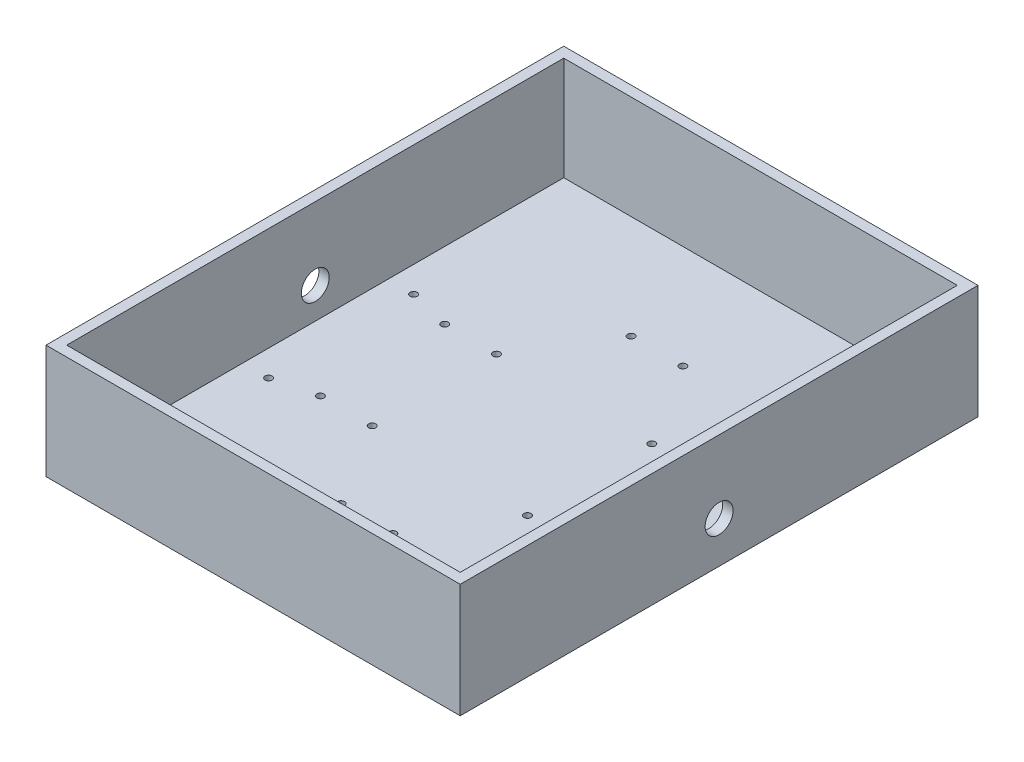
ISO-10303-21;
HEADER;
FILE_DESCRIPTION(('STEP AP214'),'2;1');
FILE_NAME('part.step','',(''),(''),'','','');
FILE_SCHEMA(('AUTOMOTIVE_DESIGN { 1 0 10303 214 1 1 1 1 }'));
ENDSEC;
DATA;
#1=APPLICATION_CONTEXT('core data for automotive mechanical design processes');
#2=APPLICATION_PROTOCOL_DEFINITION('international standard','automotive_design',2000,#1);
#3=PRODUCT_CONTEXT('',#1,'mechanical');
#4=PRODUCT('Part','Part','',(#3));
#5=PRODUCT_RELATED_PRODUCT_CATEGORY('part','',(#4));
#6=PRODUCT_DEFINITION_FORMATION('','',#4);
#7=PRODUCT_DEFINITION_CONTEXT('part definition',#1,'design');
#8=PRODUCT_DEFINITION('design','',#6,#7);
#9=PRODUCT_DEFINITION_SHAPE('','',#8);
#10=(LENGTH_UNIT() NAMED_UNIT(*) SI_UNIT(.MILLI.,.METRE.));
#11=(NAMED_UNIT(*) PLANE_ANGLE_UNIT() SI_UNIT($,.RADIAN.));
#12=(NAMED_UNIT(*) SI_UNIT($,.STERADIAN.) SOLID_ANGLE_UNIT());
#13=UNCERTAINTY_MEASURE_WITH_UNIT(LENGTH_MEASURE(1.E-05),#10,'distance_accuracy_value','');
#14=(GEOMETRIC_REPRESENTATION_CONTEXT(3) GLOBAL_UNCERTAINTY_ASSIGNED_CONTEXT((#13)) GLOBAL_UNIT_ASSIGNED_CONTEXT((#10,
#11,#12)) REPRESENTATION_CONTEXT('',''));
#15=CARTESIAN_POINT('',(0.,0.,0.));
#16=DIRECTION('',(0.,0.,1.));
#17=DIRECTION('',(1.,0.,0.));
#18=AXIS2_PLACEMENT_3D('',#15,#16,#17);
#19=CARTESIAN_POINT('',(-95.,50.,120.));
#20=DIRECTION('',(0.,-1.,0.));
#21=DIRECTION('',(1.,0.,0.));
#22=AXIS2_PLACEMENT_3D('',#19,#20,#21);
#23=PLANE('',#22);
#24=DIRECTION('',(-1.,0.,0.));
#25=VECTOR('',#24,1.);
#26=CARTESIAN_POINT('',(0.,50.,-125.));
#27=LINE('',#26,#25);
#28=CARTESIAN_POINT('',(100.,50.,-125.));
#29=VERTEX_POINT('',#28);
#30=CARTESIAN_POINT('',(-100.,50.,-125.));
#31=VERTEX_POINT('',#30);
#32=EDGE_CURVE('E88',#29,#31,#27,.T.);
#33=ORIENTED_EDGE('',*,*,#32,.T.);
#34=DIRECTION('',(0.,0.,-1.));
#35=VECTOR('',#34,1.);
#36=CARTESIAN_POINT('',(-100.,50.,120.));
#37=LINE('',#36,#35);
#38=CARTESIAN_POINT('',(-100.,50.,125.));
#39=VERTEX_POINT('',#38);
#40=EDGE_CURVE('E175',#39,#31,#37,.T.);
#41=ORIENTED_EDGE('',*,*,#40,.F.);
#42=DIRECTION('',(-1.,0.,0.));
#43=VECTOR('',#42,1.);
#44=CARTESIAN_POINT('',(0.,50.,125.));
#45=LINE('',#44,#43);
#46=CARTESIAN_POINT('',(100.,50.,125.));
#47=VERTEX_POINT('',#46);
#48=EDGE_CURVE('E72',#47,#39,#45,.T.);
#49=ORIENTED_EDGE('',*,*,#48,.F.);
#50=DIRECTION('',(0.,0.,-1.));
#51=VECTOR('',#50,1.);
#52=CARTESIAN_POINT('',(100.,50.,120.));
#53=LINE('',#52,#51);
#54=EDGE_CURVE('E167',#47,#29,#53,.T.);
#55=ORIENTED_EDGE('',*,*,#54,.T.);
#56=EDGE_LOOP('',(#33,#41,#49,#55));
#57=FACE_BOUND('',#56,.T.);
#58=DIRECTION('',(-1.,0.,0.));
#59=VECTOR('',#58,1.);
#60=CARTESIAN_POINT('',(-95.,50.,-120.));
#61=LINE('',#60,#59);
#62=CARTESIAN_POINT('',(95.,50.,-120.));
#63=VERTEX_POINT('',#62);
#64=CARTESIAN_POINT('',(-95.,50.,-120.));
#65=VERTEX_POINT('',#64);
#66=EDGE_CURVE('E141',#63,#65,#61,.T.);
#67=ORIENTED_EDGE('',*,*,#66,.F.);
#68=DIRECTION('',(0.,0.,-1.));
#69=VECTOR('',#68,1.);
#70=CARTESIAN_POINT('',(95.,50.,120.));
#71=LINE('',#70,#69);
#72=CARTESIAN_POINT('',(95.,50.,120.));
#73=VERTEX_POINT('',#72);
#74=EDGE_CURVE('E154',#73,#63,#71,.T.);
#75=ORIENTED_EDGE('',*,*,#74,.F.);
#76=DIRECTION('',(-1.,0.,0.));
#77=VECTOR('',#76,1.);
#78=CARTESIAN_POINT('',(-95.,50.,120.));
#79=LINE('',#78,#77);
#80=CARTESIAN_POINT('',(-95.,50.,120.));
#81=VERTEX_POINT('',#80);
#82=EDGE_CURVE('E63',#73,#81,#79,.T.);
#83=ORIENTED_EDGE('',*,*,#82,.T.);
#84=DIRECTION('',(0.,0.,-1.));
#85=VECTOR('',#84,1.);
#86=CARTESIAN_POINT('',(-95.,50.,120.));
#87=LINE('',#86,#85);
#88=EDGE_CURVE('E139',#81,#65,#87,.T.);
#89=ORIENTED_EDGE('',*,*,#88,.T.);
#90=EDGE_LOOP('',(#67,#75,#83,#89));
#91=FACE_BOUND('',#90,.T.);
#92=ADVANCED_FACE('F45',(#57,#91),#23,.F.);
#93=CARTESIAN_POINT('',(-100.,0.,120.));
#94=DIRECTION('',(1.,0.,0.));
#95=DIRECTION('',(0.,0.,-1.));
#96=AXIS2_PLACEMENT_3D('',#93,#94,#95);
#97=PLANE('',#96);
#98=CARTESIAN_POINT('',(-100.,15.,0.));
#99=DIRECTION('',(1.,0.,0.));
#100=DIRECTION('',(0.,0.,-1.));
#101=AXIS2_PLACEMENT_3D('',#98,#99,#100);
#102=CIRCLE('',#101,6.75);
#103=CARTESIAN_POINT('',(-100.,15.,-6.75));
#104=VERTEX_POINT('',#103);
#105=EDGE_CURVE('E339',#104,#104,#102,.T.);
#106=ORIENTED_EDGE('',*,*,#105,.T.);
#107=EDGE_LOOP('',(#106));
#108=FACE_BOUND('',#107,.T.);
#109=DIRECTION('',(0.,-1.,0.));
#110=VECTOR('',#109,1.);
#111=CARTESIAN_POINT('',(-100.,0.,-125.));
#112=LINE('',#111,#110);
#113=CARTESIAN_POINT('',(-100.,-5.,-125.));
#114=VERTEX_POINT('',#113);
#115=EDGE_CURVE('E146',#31,#114,#112,.T.);
#116=ORIENTED_EDGE('',*,*,#115,.T.);
#117=DIRECTION('',(0.,0.,-1.));
#118=VECTOR('',#117,1.);
#119=CARTESIAN_POINT('',(-100.,-5.,120.));
#120=LINE('',#119,#118);
#121=CARTESIAN_POINT('',(-100.,-5.,125.));
#122=VERTEX_POINT('',#121);
#123=EDGE_CURVE('E11',#122,#114,#120,.T.);
#124=ORIENTED_EDGE('',*,*,#123,.F.);
#125=DIRECTION('',(0.,-1.,0.));
#126=VECTOR('',#125,1.);
#127=CARTESIAN_POINT('',(-100.,0.,125.));
#128=LINE('',#127,#126);
#129=EDGE_CURVE('E158',#39,#122,#128,.T.);
#130=ORIENTED_EDGE('',*,*,#129,.F.);
#131=ORIENTED_EDGE('',*,*,#40,.T.);
#132=EDGE_LOOP('',(#116,#124,#130,#131));
#133=FACE_BOUND('',#132,.T.);
#134=ADVANCED_FACE('F287',(#108,#133),#97,.F.);
#135=CARTESIAN_POINT('',(-95.,-5.,120.));
#136=DIRECTION('',(0.,1.,0.));
#137=DIRECTION('',(-1.,0.,0.));
#138=AXIS2_PLACEMENT_3D('',#135,#136,#137);
#139=PLANE('',#138);
#140=CARTESIAN_POINT('',(-82.5000000000123,-5.00000000000002,35.));
#141=DIRECTION('',(0.,1.,0.));
#142=DIRECTION('',(1.,0.,0.));
#143=AXIS2_PLACEMENT_3D('',#140,#141,#142);
#144=CIRCLE('',#143,1.69999999999998);
#145=CARTESIAN_POINT('',(-80.8000000000124,-5.00000000000002,35.));
#146=VERTEX_POINT('',#145);
#147=EDGE_CURVE('E347',#146,#146,#144,.T.);
#148=ORIENTED_EDGE('',*,*,#147,.T.);
#149=EDGE_LOOP('',(#148));
#150=FACE_BOUND('',#149,.T.);
#151=CARTESIAN_POINT('',(82.5000000000123,-5.,35.));
#152=DIRECTION('',(0.,1.,0.));
#153=DIRECTION('',(-1.,0.,0.));
#154=AXIS2_PLACEMENT_3D('',#151,#152,#153);
#155=CIRCLE('',#154,1.69999999999998);
#156=CARTESIAN_POINT('',(80.8000000000123,-5.,35.));
#157=VERTEX_POINT('',#156);
#158=EDGE_CURVE('E376',#157,#157,#155,.T.);
#159=ORIENTED_EDGE('',*,*,#158,.T.);
#160=EDGE_LOOP('',(#159));
#161=FACE_BOUND('',#160,.T.);
#162=CARTESIAN_POINT('',(62.4999999999998,-5.00000000000001,30.));
#163=DIRECTION('',(0.,1.,0.));
#164=DIRECTION('',(-1.,0.,0.));
#165=AXIS2_PLACEMENT_3D('',#162,#163,#164);
#166=CIRCLE('',#165,1.70000000000001);
#167=CARTESIAN_POINT('',(60.7999999999998,-5.00000000000001,30.));
#168=VERTEX_POINT('',#167);
#169=EDGE_CURVE('E372',#168,#168,#166,.T.);
#170=ORIENTED_EDGE('',*,*,#169,.T.);
#171=EDGE_LOOP('',(#170));
#172=FACE_BOUND('',#171,.T.);
#173=CARTESIAN_POINT('',(37.4999999999998,-5.00000000000001,30.));
#174=DIRECTION('',(0.,1.,0.));
#175=DIRECTION('',(-1.,0.,0.));
#176=AXIS2_PLACEMENT_3D('',#173,#174,#175);
#177=CIRCLE('',#176,1.70000000000001);
#178=CARTESIAN_POINT('',(35.7999999999998,-5.00000000000001,30.));
#179=VERTEX_POINT('',#178);
#180=EDGE_CURVE('E367',#179,#179,#177,.T.);
#181=ORIENTED_EDGE('',*,*,#180,.T.);
#182=EDGE_LOOP('',(#181));
#183=FACE_BOUND('',#182,.T.);
#184=CARTESIAN_POINT('',(12.5,-5.00000000000001,69.99999999998));
#185=DIRECTION('',(0.,1.,0.));
#186=DIRECTION('',(-1.,0.,0.));
#187=AXIS2_PLACEMENT_3D('',#184,#185,#186);
#188=CIRCLE('',#187,1.70000000000001);
#189=CARTESIAN_POINT('',(10.8,-5.00000000000001,69.99999999998));
#190=VERTEX_POINT('',#189);
#191=EDGE_CURVE('E371',#190,#190,#188,.T.);
#192=ORIENTED_EDGE('',*,*,#191,.T.);
#193=EDGE_LOOP('',(#192));
#194=FACE_BOUND('',#193,.T.);
#195=CARTESIAN_POINT('',(12.5,-5.00000000000001,-69.99999999998));
#196=DIRECTION('',(0.,1.,0.));
#197=DIRECTION('',(1.,0.,0.));
#198=AXIS2_PLACEMENT_3D('',#195,#196,#197);
#199=CIRCLE('',#198,1.70000000000001);
#200=CARTESIAN_POINT('',(14.2,-5.00000000000001,-69.99999999998));
#201=VERTEX_POINT('',#200);
#202=EDGE_CURVE('E391',#201,#201,#199,.T.);
#203=ORIENTED_EDGE('',*,*,#202,.T.);
#204=EDGE_LOOP('',(#203));
#205=FACE_BOUND('',#204,.T.);
#206=CARTESIAN_POINT('',(37.4999999999998,-5.00000000000001,-30.));
#207=DIRECTION('',(0.,1.,0.));
#208=DIRECTION('',(1.,0.,0.));
#209=AXIS2_PLACEMENT_3D('',#206,#207,#208);
#210=CIRCLE('',#209,1.70000000000001);
#211=CARTESIAN_POINT('',(39.1999999999999,-5.00000000000001,-30.));
#212=VERTEX_POINT('',#211);
#213=EDGE_CURVE('E387',#212,#212,#210,.T.);
#214=ORIENTED_EDGE('',*,*,#213,.T.);
#215=EDGE_LOOP('',(#214));
#216=FACE_BOUND('',#215,.T.);
#217=CARTESIAN_POINT('',(62.4999999999999,-5.00000000000001,-30.));
#218=DIRECTION('',(0.,1.,0.));
#219=DIRECTION('',(1.,0.,0.));
#220=AXIS2_PLACEMENT_3D('',#217,#218,#219);
#221=CIRCLE('',#220,1.70000000000001);
#222=CARTESIAN_POINT('',(64.1999999999999,-5.00000000000001,-30.));
#223=VERTEX_POINT('',#222);
#224=EDGE_CURVE('E383',#223,#223,#221,.T.);
#225=ORIENTED_EDGE('',*,*,#224,.T.);
#226=EDGE_LOOP('',(#225));
#227=FACE_BOUND('',#226,.T.);
#228=CARTESIAN_POINT('',(-12.5,-5.00000000000002,-69.99999999998));
#229=DIRECTION('',(0.,1.,0.));
#230=DIRECTION('',(-1.,0.,0.));
#231=AXIS2_PLACEMENT_3D('',#228,#229,#230);
#232=CIRCLE('',#231,1.70000000000001);
#233=CARTESIAN_POINT('',(-14.2,-5.00000000000002,-69.99999999998));
#234=VERTEX_POINT('',#233);
#235=EDGE_CURVE('E343',#234,#234,#232,.T.);
#236=ORIENTED_EDGE('',*,*,#235,.T.);
#237=EDGE_LOOP('',(#236));
#238=FACE_BOUND('',#237,.T.);
#239=CARTESIAN_POINT('',(-37.4999999999998,-5.00000000000002,-30.));
#240=DIRECTION('',(0.,1.,0.));
#241=DIRECTION('',(-1.,0.,0.));
#242=AXIS2_PLACEMENT_3D('',#239,#240,#241);
#243=CIRCLE('',#242,1.70000000000001);
#244=CARTESIAN_POINT('',(-39.1999999999999,-5.00000000000002,-30.));
#245=VERTEX_POINT('',#244);
#246=EDGE_CURVE('E348',#245,#245,#243,.T.);
#247=ORIENTED_EDGE('',*,*,#246,.T.);
#248=EDGE_LOOP('',(#247));
#249=FACE_BOUND('',#248,.T.);
#250=CARTESIAN_POINT('',(-62.4999999999999,-5.00000000000002,-30.));
#251=DIRECTION('',(0.,1.,0.));
#252=DIRECTION('',(-1.,0.,0.));
#253=AXIS2_PLACEMENT_3D('',#250,#251,#252);
#254=CIRCLE('',#253,1.70000000000001);
#255=CARTESIAN_POINT('',(-64.1999999999999,-5.00000000000002,-30.));
#256=VERTEX_POINT('',#255);
#257=EDGE_CURVE('E352',#256,#256,#254,.T.);
#258=ORIENTED_EDGE('',*,*,#257,.T.);
#259=EDGE_LOOP('',(#258));
#260=FACE_BOUND('',#259,.T.);
#261=CARTESIAN_POINT('',(-82.5000000000124,-5.00000000000002,-35.));
#262=DIRECTION('',(0.,1.,0.));
#263=DIRECTION('',(-1.,0.,0.));
#264=AXIS2_PLACEMENT_3D('',#261,#262,#263);
#265=CIRCLE('',#264,1.69999999999998);
#266=CARTESIAN_POINT('',(-84.2000000000124,-5.00000000000002,-35.));
#267=VERTEX_POINT('',#266);
#268=EDGE_CURVE('E356',#267,#267,#265,.T.);
#269=ORIENTED_EDGE('',*,*,#268,.T.);
#270=EDGE_LOOP('',(#269));
#271=FACE_BOUND('',#270,.T.);
#272=CARTESIAN_POINT('',(-62.4999999999999,-5.00000000000002,30.));
#273=DIRECTION('',(0.,1.,0.));
#274=DIRECTION('',(1.,0.,0.));
#275=AXIS2_PLACEMENT_3D('',#272,#273,#274);
#276=CIRCLE('',#275,1.70000000000001);
#277=CARTESIAN_POINT('',(-60.7999999999998,-5.00000000000002,30.));
#278=VERTEX_POINT('',#277);
#279=EDGE_CURVE('E360',#278,#278,#276,.T.);
#280=ORIENTED_EDGE('',*,*,#279,.T.);
#281=EDGE_LOOP('',(#280));
#282=FACE_BOUND('',#281,.T.);
#283=CARTESIAN_POINT('',(-37.4999999999998,-5.00000000000002,30.));
#284=DIRECTION('',(0.,1.,0.));
#285=DIRECTION('',(1.,0.,0.));
#286=AXIS2_PLACEMENT_3D('',#283,#284,#285);
#287=CIRCLE('',#286,1.70000000000001);
#288=CARTESIAN_POINT('',(-35.7999999999998,-5.00000000000002,30.));
#289=VERTEX_POINT('',#288);
#290=EDGE_CURVE('E336',#289,#289,#287,.T.);
#291=ORIENTED_EDGE('',*,*,#290,.T.);
#292=EDGE_LOOP('',(#291));
#293=FACE_BOUND('',#292,.T.);
#294=CARTESIAN_POINT('',(-12.5,-5.00000000000002,69.99999999998));
#295=DIRECTION('',(0.,1.,0.));
#296=DIRECTION('',(1.,0.,0.));
#297=AXIS2_PLACEMENT_3D('',#294,#295,#296);
#298=CIRCLE('',#297,1.70000000000001);
#299=CARTESIAN_POINT('',(-10.8,-5.00000000000002,69.99999999998));
#300=VERTEX_POINT('',#299);
#301=EDGE_CURVE('E331',#300,#300,#298,.T.);
#302=ORIENTED_EDGE('',*,*,#301,.T.);
#303=EDGE_LOOP('',(#302));
#304=FACE_BOUND('',#303,.T.);
#305=CARTESIAN_POINT('',(82.5000000000124,-5.,-35.));
#306=DIRECTION('',(0.,1.,0.));
#307=DIRECTION('',(1.,0.,0.));
#308=AXIS2_PLACEMENT_3D('',#305,#306,#307);
#309=CIRCLE('',#308,1.69999999999998);
#310=CARTESIAN_POINT('',(84.2000000000124,-5.,-35.));
#311=VERTEX_POINT('',#310);
#312=EDGE_CURVE('E189',#311,#311,#309,.T.);
#313=ORIENTED_EDGE('',*,*,#312,.T.);
#314=EDGE_LOOP('',(#313));
#315=FACE_BOUND('',#314,.T.);
#316=DIRECTION('',(1.,0.,0.));
#317=VECTOR('',#316,1.);
#318=CARTESIAN_POINT('',(0.,-4.99999999999999,-125.));
#319=LINE('',#318,#317);
#320=CARTESIAN_POINT('',(100.,-4.99999999999998,-125.));
#321=VERTEX_POINT('',#320);
#322=EDGE_CURVE('E152',#114,#321,#319,.T.);
#323=ORIENTED_EDGE('',*,*,#322,.T.);
#324=DIRECTION('',(0.,0.,-1.));
#325=VECTOR('',#324,1.);
#326=CARTESIAN_POINT('',(100.,-4.99999999999998,120.));
#327=LINE('',#326,#325);
#328=CARTESIAN_POINT('',(100.,-4.99999999999998,125.));
#329=VERTEX_POINT('',#328);
#330=EDGE_CURVE('E55',#329,#321,#327,.T.);
#331=ORIENTED_EDGE('',*,*,#330,.F.);
#332=DIRECTION('',(1.,0.,0.));
#333=VECTOR('',#332,1.);
#334=CARTESIAN_POINT('',(0.,-4.99999999999999,125.));
#335=LINE('',#334,#333);
#336=EDGE_CURVE('E94',#122,#329,#335,.T.);
#337=ORIENTED_EDGE('',*,*,#336,.F.);
#338=ORIENTED_EDGE('',*,*,#123,.T.);
#339=EDGE_LOOP('',(#323,#331,#337,#338));
#340=FACE_BOUND('',#339,.T.);
#341=ADVANCED_FACE('F293',(#150,#161,#172,#183,#194,#205,#216,#227,#238,#249,#260,#271,#282,
#293,#304,#315,#340),#139,.F.);
#342=CARTESIAN_POINT('',(100.,0.,120.));
#343=DIRECTION('',(-1.,0.,0.));
#344=DIRECTION('',(0.,-1.,0.));
#345=AXIS2_PLACEMENT_3D('',#342,#343,#344);
#346=PLANE('',#345);
#347=CARTESIAN_POINT('',(100.,15.,0.));
#348=DIRECTION('',(1.,0.,0.));
#349=DIRECTION('',(0.,0.,-1.));
#350=AXIS2_PLACEMENT_3D('',#347,#348,#349);
#351=CIRCLE('',#350,6.75);
#352=CARTESIAN_POINT('',(100.,15.,-6.75));
#353=VERTEX_POINT('',#352);
#354=EDGE_CURVE('E481',#353,#353,#351,.T.);
#355=ORIENTED_EDGE('',*,*,#354,.F.);
#356=EDGE_LOOP('',(#355));
#357=FACE_BOUND('',#356,.T.);
#358=DIRECTION('',(0.,1.,0.));
#359=VECTOR('',#358,1.);
#360=CARTESIAN_POINT('',(100.,0.,-125.));
#361=LINE('',#360,#359);
#362=EDGE_CURVE('E163',#321,#29,#361,.T.);
#363=ORIENTED_EDGE('',*,*,#362,.T.);
#364=ORIENTED_EDGE('',*,*,#54,.F.);
#365=DIRECTION('',(0.,1.,0.));
#366=VECTOR('',#365,1.);
#367=CARTESIAN_POINT('',(100.,0.,125.));
#368=LINE('',#367,#366);
#369=EDGE_CURVE('E170',#329,#47,#368,.T.);
#370=ORIENTED_EDGE('',*,*,#369,.F.);
#371=ORIENTED_EDGE('',*,*,#330,.T.);
#372=EDGE_LOOP('',(#363,#364,#370,#371));
#373=FACE_BOUND('',#372,.T.);
#374=ADVANCED_FACE('F300',(#357,#373),#346,.F.);
#375=CARTESIAN_POINT('',(0.,0.,125.));
#376=DIRECTION('',(0.,0.,-1.));
#377=DIRECTION('',(-1.,0.,0.));
#378=AXIS2_PLACEMENT_3D('',#375,#376,#377);
#379=PLANE('',#378);
#380=ORIENTED_EDGE('',*,*,#129,.T.);
#381=ORIENTED_EDGE('',*,*,#336,.T.);
#382=ORIENTED_EDGE('',*,*,#369,.T.);
#383=ORIENTED_EDGE('',*,*,#48,.T.);
#384=EDGE_LOOP('',(#380,#381,#382,#383));
#385=FACE_BOUND('',#384,.T.);
#386=ADVANCED_FACE('F303',(#385),#379,.F.);
#387=CARTESIAN_POINT('',(0.,0.,-125.));
#388=DIRECTION('',(0.,0.,-1.));
#389=DIRECTION('',(-1.,0.,0.));
#390=AXIS2_PLACEMENT_3D('',#387,#388,#389);
#391=PLANE('',#390);
#392=ORIENTED_EDGE('',*,*,#115,.F.);
#393=ORIENTED_EDGE('',*,*,#32,.F.);
#394=ORIENTED_EDGE('',*,*,#362,.F.);
#395=ORIENTED_EDGE('',*,*,#322,.F.);
#396=EDGE_LOOP('',(#392,#393,#394,#395));
#397=FACE_BOUND('',#396,.T.);
#398=ADVANCED_FACE('F47',(#397),#391,.T.);
#399=CARTESIAN_POINT('',(-95.,0.,120.));
#400=DIRECTION('',(1.,0.,0.));
#401=DIRECTION('',(0.,0.,-1.));
#402=AXIS2_PLACEMENT_3D('',#399,#400,#401);
#403=PLANE('',#402);
#404=CARTESIAN_POINT('',(-95.,15.,0.));
#405=DIRECTION('',(1.,0.,0.));
#406=DIRECTION('',(0.,0.,-1.));
#407=AXIS2_PLACEMENT_3D('',#404,#405,#406);
#408=CIRCLE('',#407,6.75);
#409=CARTESIAN_POINT('',(-95.,15.,-6.75));
#410=VERTEX_POINT('',#409);
#411=EDGE_CURVE('E328',#410,#410,#408,.T.);
#412=ORIENTED_EDGE('',*,*,#411,.F.);
#413=EDGE_LOOP('',(#412));
#414=FACE_BOUND('',#413,.T.);
#415=DIRECTION('',(0.,-1.,0.));
#416=VECTOR('',#415,1.);
#417=CARTESIAN_POINT('',(-95.,0.,-120.));
#418=LINE('',#417,#416);
#419=CARTESIAN_POINT('',(-95.,0.,-120.));
#420=VERTEX_POINT('',#419);
#421=EDGE_CURVE('E247',#65,#420,#418,.T.);
#422=ORIENTED_EDGE('',*,*,#421,.F.);
#423=ORIENTED_EDGE('',*,*,#88,.F.);
#424=DIRECTION('',(0.,-1.,0.));
#425=VECTOR('',#424,1.);
#426=CARTESIAN_POINT('',(-95.,0.,120.));
#427=LINE('',#426,#425);
#428=CARTESIAN_POINT('',(-95.,0.,120.));
#429=VERTEX_POINT('',#428);
#430=EDGE_CURVE('E124',#81,#429,#427,.T.);
#431=ORIENTED_EDGE('',*,*,#430,.T.);
#432=DIRECTION('',(0.,0.,-1.));
#433=VECTOR('',#432,1.);
#434=CARTESIAN_POINT('',(-95.,0.,120.));
#435=LINE('',#434,#433);
#436=EDGE_CURVE('E136',#429,#420,#435,.T.);
#437=ORIENTED_EDGE('',*,*,#436,.T.);
#438=EDGE_LOOP('',(#422,#423,#431,#437));
#439=FACE_BOUND('',#438,.T.);
#440=ADVANCED_FACE('F135',(#414,#439),#403,.T.);
#441=CARTESIAN_POINT('',(-95.,0.,120.));
#442=DIRECTION('',(0.,1.,0.));
#443=DIRECTION('',(-1.,0.,0.));
#444=AXIS2_PLACEMENT_3D('',#441,#442,#443);
#445=PLANE('',#444);
#446=CARTESIAN_POINT('',(-82.5000000000123,0.,35.));
#447=DIRECTION('',(0.,1.,0.));
#448=DIRECTION('',(-1.,0.,0.));
#449=AXIS2_PLACEMENT_3D('',#446,#447,#448);
#450=CIRCLE('',#449,1.69999999999998);
#451=CARTESIAN_POINT('',(-84.2000000000123,0.,35.));
#452=VERTEX_POINT('',#451);
#453=EDGE_CURVE('E244',#452,#452,#450,.T.);
#454=ORIENTED_EDGE('',*,*,#453,.F.);
#455=EDGE_LOOP('',(#454));
#456=FACE_BOUND('',#455,.T.);
#457=CARTESIAN_POINT('',(82.5000000000123,0.,35.));
#458=DIRECTION('',(0.,1.,0.));
#459=DIRECTION('',(-1.,0.,0.));
#460=AXIS2_PLACEMENT_3D('',#457,#458,#459);
#461=CIRCLE('',#460,1.69999999999998);
#462=CARTESIAN_POINT('',(80.8000000000123,0.,35.));
#463=VERTEX_POINT('',#462);
#464=EDGE_CURVE('E241',#463,#463,#461,.T.);
#465=ORIENTED_EDGE('',*,*,#464,.F.);
#466=EDGE_LOOP('',(#465));
#467=FACE_BOUND('',#466,.T.);
#468=CARTESIAN_POINT('',(62.4999999999998,0.,30.));
#469=DIRECTION('',(0.,1.,0.));
#470=DIRECTION('',(-1.,0.,0.));
#471=AXIS2_PLACEMENT_3D('',#468,#469,#470);
#472=CIRCLE('',#471,1.70000000000001);
#473=CARTESIAN_POINT('',(60.7999999999998,0.,30.));
#474=VERTEX_POINT('',#473);
#475=EDGE_CURVE('E237',#474,#474,#472,.T.);
#476=ORIENTED_EDGE('',*,*,#475,.F.);
#477=EDGE_LOOP('',(#476));
#478=FACE_BOUND('',#477,.T.);
#479=CARTESIAN_POINT('',(37.4999999999998,0.,30.));
#480=DIRECTION('',(0.,1.,0.));
#481=DIRECTION('',(-1.,0.,0.));
#482=AXIS2_PLACEMENT_3D('',#479,#480,#481);
#483=CIRCLE('',#482,1.70000000000001);
#484=CARTESIAN_POINT('',(35.7999999999998,0.,30.));
#485=VERTEX_POINT('',#484);
#486=EDGE_CURVE('E233',#485,#485,#483,.T.);
#487=ORIENTED_EDGE('',*,*,#486,.F.);
#488=EDGE_LOOP('',(#487));
#489=FACE_BOUND('',#488,.T.);
#490=CARTESIAN_POINT('',(12.5,0.,69.99999999998));
#491=DIRECTION('',(0.,1.,0.));
#492=DIRECTION('',(-1.,0.,0.));
#493=AXIS2_PLACEMENT_3D('',#490,#491,#492);
#494=CIRCLE('',#493,1.70000000000001);
#495=CARTESIAN_POINT('',(10.8,0.,69.99999999998));
#496=VERTEX_POINT('',#495);
#497=EDGE_CURVE('E229',#496,#496,#494,.T.);
#498=ORIENTED_EDGE('',*,*,#497,.F.);
#499=EDGE_LOOP('',(#498));
#500=FACE_BOUND('',#499,.T.);
#501=CARTESIAN_POINT('',(12.5,0.,-69.99999999998));
#502=DIRECTION('',(0.,1.,0.));
#503=DIRECTION('',(-1.,0.,0.));
#504=AXIS2_PLACEMENT_3D('',#501,#502,#503);
#505=CIRCLE('',#504,1.70000000000001);
#506=CARTESIAN_POINT('',(10.8,0.,-69.99999999998));
#507=VERTEX_POINT('',#506);
#508=EDGE_CURVE('E225',#507,#507,#505,.T.);
#509=ORIENTED_EDGE('',*,*,#508,.F.);
#510=EDGE_LOOP('',(#509));
#511=FACE_BOUND('',#510,.T.);
#512=CARTESIAN_POINT('',(37.4999999999998,0.,-30.));
#513=DIRECTION('',(0.,1.,0.));
#514=DIRECTION('',(-1.,0.,0.));
#515=AXIS2_PLACEMENT_3D('',#512,#513,#514);
#516=CIRCLE('',#515,1.70000000000001);
#517=CARTESIAN_POINT('',(35.7999999999998,0.,-30.));
#518=VERTEX_POINT('',#517);
#519=EDGE_CURVE('E221',#518,#518,#516,.T.);
#520=ORIENTED_EDGE('',*,*,#519,.F.);
#521=EDGE_LOOP('',(#520));
#522=FACE_BOUND('',#521,.T.);
#523=CARTESIAN_POINT('',(62.4999999999999,0.,-30.));
#524=DIRECTION('',(0.,1.,0.));
#525=DIRECTION('',(-1.,0.,0.));
#526=AXIS2_PLACEMENT_3D('',#523,#524,#525);
#527=CIRCLE('',#526,1.70000000000001);
#528=CARTESIAN_POINT('',(60.7999999999999,0.,-30.));
#529=VERTEX_POINT('',#528);
#530=EDGE_CURVE('E217',#529,#529,#527,.T.);
#531=ORIENTED_EDGE('',*,*,#530,.F.);
#532=EDGE_LOOP('',(#531));
#533=FACE_BOUND('',#532,.T.);
#534=CARTESIAN_POINT('',(-12.5,0.,-69.99999999998));
#535=DIRECTION('',(0.,1.,0.));
#536=DIRECTION('',(-1.,0.,0.));
#537=AXIS2_PLACEMENT_3D('',#534,#535,#536);
#538=CIRCLE('',#537,1.70000000000001);
#539=CARTESIAN_POINT('',(-14.2,0.,-69.99999999998));
#540=VERTEX_POINT('',#539);
#541=EDGE_CURVE('E213',#540,#540,#538,.T.);
#542=ORIENTED_EDGE('',*,*,#541,.F.);
#543=EDGE_LOOP('',(#542));
#544=FACE_BOUND('',#543,.T.);
#545=CARTESIAN_POINT('',(-37.4999999999998,0.,-30.));
#546=DIRECTION('',(0.,1.,0.));
#547=DIRECTION('',(-1.,0.,0.));
#548=AXIS2_PLACEMENT_3D('',#545,#546,#547);
#549=CIRCLE('',#548,1.70000000000001);
#550=CARTESIAN_POINT('',(-39.1999999999999,0.,-30.));
#551=VERTEX_POINT('',#550);
#552=EDGE_CURVE('E209',#551,#551,#549,.T.);
#553=ORIENTED_EDGE('',*,*,#552,.F.);
#554=EDGE_LOOP('',(#553));
#555=FACE_BOUND('',#554,.T.);
#556=CARTESIAN_POINT('',(-62.4999999999999,0.,-30.));
#557=DIRECTION('',(0.,1.,0.));
#558=DIRECTION('',(-1.,0.,0.));
#559=AXIS2_PLACEMENT_3D('',#556,#557,#558);
#560=CIRCLE('',#559,1.70000000000001);
#561=CARTESIAN_POINT('',(-64.1999999999999,0.,-30.));
#562=VERTEX_POINT('',#561);
#563=EDGE_CURVE('E205',#562,#562,#560,.T.);
#564=ORIENTED_EDGE('',*,*,#563,.F.);
#565=EDGE_LOOP('',(#564));
#566=FACE_BOUND('',#565,.T.);
#567=CARTESIAN_POINT('',(-82.5000000000124,0.,-35.));
#568=DIRECTION('',(0.,1.,0.));
#569=DIRECTION('',(-1.,0.,0.));
#570=AXIS2_PLACEMENT_3D('',#567,#568,#569);
#571=CIRCLE('',#570,1.69999999999998);
#572=CARTESIAN_POINT('',(-84.2000000000124,0.,-35.));
#573=VERTEX_POINT('',#572);
#574=EDGE_CURVE('E201',#573,#573,#571,.T.);
#575=ORIENTED_EDGE('',*,*,#574,.F.);
#576=EDGE_LOOP('',(#575));
#577=FACE_BOUND('',#576,.T.);
#578=CARTESIAN_POINT('',(-62.4999999999999,0.,30.));
#579=DIRECTION('',(0.,1.,0.));
#580=DIRECTION('',(-1.,0.,0.));
#581=AXIS2_PLACEMENT_3D('',#578,#579,#580);
#582=CIRCLE('',#581,1.70000000000001);
#583=CARTESIAN_POINT('',(-64.1999999999999,0.,30.));
#584=VERTEX_POINT('',#583);
#585=EDGE_CURVE('E197',#584,#584,#582,.T.);
#586=ORIENTED_EDGE('',*,*,#585,.F.);
#587=EDGE_LOOP('',(#586));
#588=FACE_BOUND('',#587,.T.);
#589=CARTESIAN_POINT('',(-37.4999999999998,0.,30.));
#590=DIRECTION('',(0.,1.,0.));
#591=DIRECTION('',(-1.,0.,0.));
#592=AXIS2_PLACEMENT_3D('',#589,#590,#591);
#593=CIRCLE('',#592,1.70000000000001);
#594=CARTESIAN_POINT('',(-39.1999999999998,0.,30.));
#595=VERTEX_POINT('',#594);
#596=EDGE_CURVE('E193',#595,#595,#593,.T.);
#597=ORIENTED_EDGE('',*,*,#596,.F.);
#598=EDGE_LOOP('',(#597));
#599=FACE_BOUND('',#598,.T.);
#600=CARTESIAN_POINT('',(-12.5,0.,69.99999999998));
#601=DIRECTION('',(0.,1.,0.));
#602=DIRECTION('',(-1.,0.,0.));
#603=AXIS2_PLACEMENT_3D('',#600,#601,#602);
#604=CIRCLE('',#603,1.70000000000001);
#605=CARTESIAN_POINT('',(-14.2,0.,69.99999999998));
#606=VERTEX_POINT('',#605);
#607=EDGE_CURVE('E188',#606,#606,#604,.T.);
#608=ORIENTED_EDGE('',*,*,#607,.F.);
#609=EDGE_LOOP('',(#608));
#610=FACE_BOUND('',#609,.T.);
#611=CARTESIAN_POINT('',(82.5000000000124,0.,-35.));
#612=DIRECTION('',(0.,1.,0.));
#613=DIRECTION('',(-1.,0.,0.));
#614=AXIS2_PLACEMENT_3D('',#611,#612,#613);
#615=CIRCLE('',#614,1.69999999999998);
#616=CARTESIAN_POINT('',(80.8000000000124,0.,-35.));
#617=VERTEX_POINT('',#616);
#618=EDGE_CURVE('E184',#617,#617,#615,.T.);
#619=ORIENTED_EDGE('',*,*,#618,.F.);
#620=EDGE_LOOP('',(#619));
#621=FACE_BOUND('',#620,.T.);
#622=DIRECTION('',(1.,0.,0.));
#623=VECTOR('',#622,1.);
#624=CARTESIAN_POINT('',(-95.,0.,-120.));
#625=LINE('',#624,#623);
#626=CARTESIAN_POINT('',(95.,0.,-120.));
#627=VERTEX_POINT('',#626);
#628=EDGE_CURVE('E144',#420,#627,#625,.T.);
#629=ORIENTED_EDGE('',*,*,#628,.F.);
#630=ORIENTED_EDGE('',*,*,#436,.F.);
#631=DIRECTION('',(1.,0.,0.));
#632=VECTOR('',#631,1.);
#633=CARTESIAN_POINT('',(-95.,0.,120.));
#634=LINE('',#633,#632);
#635=CARTESIAN_POINT('',(95.,0.,120.));
#636=VERTEX_POINT('',#635);
#637=EDGE_CURVE('E121',#429,#636,#634,.T.);
#638=ORIENTED_EDGE('',*,*,#637,.T.);
#639=DIRECTION('',(0.,0.,-1.));
#640=VECTOR('',#639,1.);
#641=CARTESIAN_POINT('',(95.,0.,120.));
#642=LINE('',#641,#640);
#643=EDGE_CURVE('E147',#636,#627,#642,.T.);
#644=ORIENTED_EDGE('',*,*,#643,.T.);
#645=EDGE_LOOP('',(#629,#630,#638,#644));
#646=FACE_BOUND('',#645,.T.);
#647=ADVANCED_FACE('F143',(#456,#467,#478,#489,#500,#511,#522,#533,#544,#555,#566,#577,#588,
#599,#610,#621,#646),#445,.T.);
#648=CARTESIAN_POINT('',(95.,0.,120.));
#649=DIRECTION('',(-1.,0.,0.));
#650=DIRECTION('',(0.,-1.,0.));
#651=AXIS2_PLACEMENT_3D('',#648,#649,#650);
#652=PLANE('',#651);
#653=CARTESIAN_POINT('',(95.,15.,0.));
#654=DIRECTION('',(-1.,0.,0.));
#655=DIRECTION('',(0.,-1.,0.));
#656=AXIS2_PLACEMENT_3D('',#653,#654,#655);
#657=CIRCLE('',#656,6.75);
#658=CARTESIAN_POINT('',(95.,15.,-6.75));
#659=VERTEX_POINT('',#658);
#660=EDGE_CURVE('E49',#659,#659,#657,.T.);
#661=ORIENTED_EDGE('',*,*,#660,.F.);
#662=EDGE_LOOP('',(#661));
#663=FACE_BOUND('',#662,.T.);
#664=DIRECTION('',(0.,1.,0.));
#665=VECTOR('',#664,1.);
#666=CARTESIAN_POINT('',(95.,0.,-120.));
#667=LINE('',#666,#665);
#668=EDGE_CURVE('E254',#627,#63,#667,.T.);
#669=ORIENTED_EDGE('',*,*,#668,.F.);
#670=ORIENTED_EDGE('',*,*,#643,.F.);
#671=DIRECTION('',(0.,1.,0.));
#672=VECTOR('',#671,1.);
#673=CARTESIAN_POINT('',(95.,0.,120.));
#674=LINE('',#673,#672);
#675=EDGE_CURVE('E125',#636,#73,#674,.T.);
#676=ORIENTED_EDGE('',*,*,#675,.T.);
#677=ORIENTED_EDGE('',*,*,#74,.T.);
#678=EDGE_LOOP('',(#669,#670,#676,#677));
#679=FACE_BOUND('',#678,.T.);
#680=ADVANCED_FACE('F270',(#663,#679),#652,.T.);
#681=CARTESIAN_POINT('',(0.,0.,120.));
#682=DIRECTION('',(0.,0.,-1.));
#683=DIRECTION('',(-1.,0.,0.));
#684=AXIS2_PLACEMENT_3D('',#681,#682,#683);
#685=PLANE('',#684);
#686=ORIENTED_EDGE('',*,*,#430,.F.);
#687=ORIENTED_EDGE('',*,*,#82,.F.);
#688=ORIENTED_EDGE('',*,*,#675,.F.);
#689=ORIENTED_EDGE('',*,*,#637,.F.);
#690=EDGE_LOOP('',(#686,#687,#688,#689));
#691=FACE_BOUND('',#690,.T.);
#692=ADVANCED_FACE('F123',(#691),#685,.T.);
#693=CARTESIAN_POINT('',(0.,0.,-120.));
#694=DIRECTION('',(0.,0.,-1.));
#695=DIRECTION('',(-1.,0.,0.));
#696=AXIS2_PLACEMENT_3D('',#693,#694,#695);
#697=PLANE('',#696);
#698=ORIENTED_EDGE('',*,*,#421,.T.);
#699=ORIENTED_EDGE('',*,*,#628,.T.);
#700=ORIENTED_EDGE('',*,*,#668,.T.);
#701=ORIENTED_EDGE('',*,*,#66,.T.);
#702=EDGE_LOOP('',(#698,#699,#700,#701));
#703=FACE_BOUND('',#702,.T.);
#704=ADVANCED_FACE('F272',(#703),#697,.F.);
#705=CARTESIAN_POINT('',(82.5000000000124,-5.,-35.));
#706=DIRECTION('',(0.,1.,0.));
#707=DIRECTION('',(-1.,0.,0.));
#708=AXIS2_PLACEMENT_3D('',#705,#706,#707);
#709=CYLINDRICAL_SURFACE('',#708,1.69999999999998);
#710=ORIENTED_EDGE('',*,*,#618,.T.);
#711=EDGE_LOOP('',(#710));
#712=FACE_BOUND('',#711,.T.);
#713=ORIENTED_EDGE('',*,*,#312,.F.);
#714=EDGE_LOOP('',(#713));
#715=FACE_BOUND('',#714,.T.);
#716=ADVANCED_FACE('F274',(#712,#715),#709,.F.);
#717=CARTESIAN_POINT('',(-12.5,-5.00000000000002,69.99999999998));
#718=DIRECTION('',(0.,1.,0.));
#719=DIRECTION('',(-1.,0.,0.));
#720=AXIS2_PLACEMENT_3D('',#717,#718,#719);
#721=CYLINDRICAL_SURFACE('',#720,1.70000000000001);
#722=ORIENTED_EDGE('',*,*,#607,.T.);
#723=EDGE_LOOP('',(#722));
#724=FACE_BOUND('',#723,.T.);
#725=ORIENTED_EDGE('',*,*,#301,.F.);
#726=EDGE_LOOP('',(#725));
#727=FACE_BOUND('',#726,.T.);
#728=ADVANCED_FACE('F281',(#724,#727),#721,.F.);
#729=CARTESIAN_POINT('',(-37.4999999999998,-5.00000000000002,30.));
#730=DIRECTION('',(0.,1.,0.));
#731=DIRECTION('',(-1.,0.,0.));
#732=AXIS2_PLACEMENT_3D('',#729,#730,#731);
#733=CYLINDRICAL_SURFACE('',#732,1.70000000000001);
#734=ORIENTED_EDGE('',*,*,#596,.T.);
#735=EDGE_LOOP('',(#734));
#736=FACE_BOUND('',#735,.T.);
#737=ORIENTED_EDGE('',*,*,#290,.F.);
#738=EDGE_LOOP('',(#737));
#739=FACE_BOUND('',#738,.T.);
#740=ADVANCED_FACE('F447',(#736,#739),#733,.F.);
#741=CARTESIAN_POINT('',(-62.4999999999999,-5.00000000000002,30.));
#742=DIRECTION('',(0.,1.,0.));
#743=DIRECTION('',(-1.,0.,0.));
#744=AXIS2_PLACEMENT_3D('',#741,#742,#743);
#745=CYLINDRICAL_SURFACE('',#744,1.70000000000001);
#746=ORIENTED_EDGE('',*,*,#585,.T.);
#747=EDGE_LOOP('',(#746));
#748=FACE_BOUND('',#747,.T.);
#749=ORIENTED_EDGE('',*,*,#279,.F.);
#750=EDGE_LOOP('',(#749));
#751=FACE_BOUND('',#750,.T.);
#752=ADVANCED_FACE('F451',(#748,#751),#745,.F.);
#753=CARTESIAN_POINT('',(-82.5000000000124,-5.00000000000002,-35.));
#754=DIRECTION('',(0.,1.,0.));
#755=DIRECTION('',(-1.,0.,0.));
#756=AXIS2_PLACEMENT_3D('',#753,#754,#755);
#757=CYLINDRICAL_SURFACE('',#756,1.69999999999998);
#758=ORIENTED_EDGE('',*,*,#574,.T.);
#759=EDGE_LOOP('',(#758));
#760=FACE_BOUND('',#759,.T.);
#761=ORIENTED_EDGE('',*,*,#268,.F.);
#762=EDGE_LOOP('',(#761));
#763=FACE_BOUND('',#762,.T.);
#764=ADVANCED_FACE('F455',(#760,#763),#757,.F.);
#765=CARTESIAN_POINT('',(-62.4999999999999,-5.00000000000002,-30.));
#766=DIRECTION('',(0.,1.,0.));
#767=DIRECTION('',(-1.,0.,0.));
#768=AXIS2_PLACEMENT_3D('',#765,#766,#767);
#769=CYLINDRICAL_SURFACE('',#768,1.70000000000001);
#770=ORIENTED_EDGE('',*,*,#563,.T.);
#771=EDGE_LOOP('',(#770));
#772=FACE_BOUND('',#771,.T.);
#773=ORIENTED_EDGE('',*,*,#257,.F.);
#774=EDGE_LOOP('',(#773));
#775=FACE_BOUND('',#774,.T.);
#776=ADVANCED_FACE('F459',(#772,#775),#769,.F.);
#777=CARTESIAN_POINT('',(-37.4999999999998,-5.00000000000002,-30.));
#778=DIRECTION('',(0.,1.,0.));
#779=DIRECTION('',(-1.,0.,0.));
#780=AXIS2_PLACEMENT_3D('',#777,#778,#779);
#781=CYLINDRICAL_SURFACE('',#780,1.70000000000001);
#782=ORIENTED_EDGE('',*,*,#552,.T.);
#783=EDGE_LOOP('',(#782));
#784=FACE_BOUND('',#783,.T.);
#785=ORIENTED_EDGE('',*,*,#246,.F.);
#786=EDGE_LOOP('',(#785));
#787=FACE_BOUND('',#786,.T.);
#788=ADVANCED_FACE('F463',(#784,#787),#781,.F.);
#789=CARTESIAN_POINT('',(-12.5,-5.00000000000002,-69.99999999998));
#790=DIRECTION('',(0.,1.,0.));
#791=DIRECTION('',(-1.,0.,0.));
#792=AXIS2_PLACEMENT_3D('',#789,#790,#791);
#793=CYLINDRICAL_SURFACE('',#792,1.70000000000001);
#794=ORIENTED_EDGE('',*,*,#541,.T.);
#795=EDGE_LOOP('',(#794));
#796=FACE_BOUND('',#795,.T.);
#797=ORIENTED_EDGE('',*,*,#235,.F.);
#798=EDGE_LOOP('',(#797));
#799=FACE_BOUND('',#798,.T.);
#800=ADVANCED_FACE('F432',(#796,#799),#793,.F.);
#801=CARTESIAN_POINT('',(62.4999999999999,-5.00000000000001,-30.));
#802=DIRECTION('',(0.,1.,0.));
#803=DIRECTION('',(-1.,0.,0.));
#804=AXIS2_PLACEMENT_3D('',#801,#802,#803);
#805=CYLINDRICAL_SURFACE('',#804,1.70000000000001);
#806=ORIENTED_EDGE('',*,*,#530,.T.);
#807=EDGE_LOOP('',(#806));
#808=FACE_BOUND('',#807,.T.);
#809=ORIENTED_EDGE('',*,*,#224,.F.);
#810=EDGE_LOOP('',(#809));
#811=FACE_BOUND('',#810,.T.);
#812=ADVANCED_FACE('F428',(#808,#811),#805,.F.);
#813=CARTESIAN_POINT('',(37.4999999999998,-5.00000000000001,-30.));
#814=DIRECTION('',(0.,1.,0.));
#815=DIRECTION('',(-1.,0.,0.));
#816=AXIS2_PLACEMENT_3D('',#813,#814,#815);
#817=CYLINDRICAL_SURFACE('',#816,1.70000000000001);
#818=ORIENTED_EDGE('',*,*,#519,.T.);
#819=EDGE_LOOP('',(#818));
#820=FACE_BOUND('',#819,.T.);
#821=ORIENTED_EDGE('',*,*,#213,.F.);
#822=EDGE_LOOP('',(#821));
#823=FACE_BOUND('',#822,.T.);
#824=ADVANCED_FACE('F422',(#820,#823),#817,.F.);
#825=CARTESIAN_POINT('',(12.5,-5.00000000000001,-69.99999999998));
#826=DIRECTION('',(0.,1.,0.));
#827=DIRECTION('',(-1.,0.,0.));
#828=AXIS2_PLACEMENT_3D('',#825,#826,#827);
#829=CYLINDRICAL_SURFACE('',#828,1.70000000000001);
#830=ORIENTED_EDGE('',*,*,#508,.T.);
#831=EDGE_LOOP('',(#830));
#832=FACE_BOUND('',#831,.T.);
#833=ORIENTED_EDGE('',*,*,#202,.F.);
#834=EDGE_LOOP('',(#833));
#835=FACE_BOUND('',#834,.T.);
#836=ADVANCED_FACE('F412',(#832,#835),#829,.F.);
#837=CARTESIAN_POINT('',(12.5,-5.00000000000001,69.99999999998));
#838=DIRECTION('',(0.,1.,0.));
#839=DIRECTION('',(-1.,0.,0.));
#840=AXIS2_PLACEMENT_3D('',#837,#838,#839);
#841=CYLINDRICAL_SURFACE('',#840,1.70000000000001);
#842=ORIENTED_EDGE('',*,*,#497,.T.);
#843=EDGE_LOOP('',(#842));
#844=FACE_BOUND('',#843,.T.);
#845=ORIENTED_EDGE('',*,*,#191,.F.);
#846=EDGE_LOOP('',(#845));
#847=FACE_BOUND('',#846,.T.);
#848=ADVANCED_FACE('F409',(#844,#847),#841,.F.);
#849=CARTESIAN_POINT('',(37.4999999999998,-5.00000000000001,30.));
#850=DIRECTION('',(0.,1.,0.));
#851=DIRECTION('',(-1.,0.,0.));
#852=AXIS2_PLACEMENT_3D('',#849,#850,#851);
#853=CYLINDRICAL_SURFACE('',#852,1.70000000000001);
#854=ORIENTED_EDGE('',*,*,#486,.T.);
#855=EDGE_LOOP('',(#854));
#856=FACE_BOUND('',#855,.T.);
#857=ORIENTED_EDGE('',*,*,#180,.F.);
#858=EDGE_LOOP('',(#857));
#859=FACE_BOUND('',#858,.T.);
#860=ADVANCED_FACE('F411',(#856,#859),#853,.F.);
#861=CARTESIAN_POINT('',(62.4999999999998,-5.00000000000001,30.));
#862=DIRECTION('',(0.,1.,0.));
#863=DIRECTION('',(-1.,0.,0.));
#864=AXIS2_PLACEMENT_3D('',#861,#862,#863);
#865=CYLINDRICAL_SURFACE('',#864,1.70000000000001);
#866=ORIENTED_EDGE('',*,*,#475,.T.);
#867=EDGE_LOOP('',(#866));
#868=FACE_BOUND('',#867,.T.);
#869=ORIENTED_EDGE('',*,*,#169,.F.);
#870=EDGE_LOOP('',(#869));
#871=FACE_BOUND('',#870,.T.);
#872=ADVANCED_FACE('F419',(#868,#871),#865,.F.);
#873=CARTESIAN_POINT('',(82.5000000000123,-5.,35.));
#874=DIRECTION('',(0.,1.,0.));
#875=DIRECTION('',(-1.,0.,0.));
#876=AXIS2_PLACEMENT_3D('',#873,#874,#875);
#877=CYLINDRICAL_SURFACE('',#876,1.69999999999998);
#878=ORIENTED_EDGE('',*,*,#464,.T.);
#879=EDGE_LOOP('',(#878));
#880=FACE_BOUND('',#879,.T.);
#881=ORIENTED_EDGE('',*,*,#158,.F.);
#882=EDGE_LOOP('',(#881));
#883=FACE_BOUND('',#882,.T.);
#884=ADVANCED_FACE('F438',(#880,#883),#877,.F.);
#885=CARTESIAN_POINT('',(-82.5000000000123,-5.00000000000002,35.));
#886=DIRECTION('',(0.,1.,0.));
#887=DIRECTION('',(-1.,0.,0.));
#888=AXIS2_PLACEMENT_3D('',#885,#886,#887);
#889=CYLINDRICAL_SURFACE('',#888,1.69999999999998);
#890=ORIENTED_EDGE('',*,*,#453,.T.);
#891=EDGE_LOOP('',(#890));
#892=FACE_BOUND('',#891,.T.);
#893=ORIENTED_EDGE('',*,*,#147,.F.);
#894=EDGE_LOOP('',(#893));
#895=FACE_BOUND('',#894,.T.);
#896=ADVANCED_FACE('F434',(#892,#895),#889,.F.);
#897=CARTESIAN_POINT('',(-100.,15.,0.));
#898=DIRECTION('',(1.,0.,0.));
#899=DIRECTION('',(0.,0.,-1.));
#900=AXIS2_PLACEMENT_3D('',#897,#898,#899);
#901=CYLINDRICAL_SURFACE('',#900,6.75);
#902=CARTESIAN_POINT('',(95.,15.,-6.75));
#903=CARTESIAN_POINT('',(95.0520833333334,15.,-6.75));
#904=CARTESIAN_POINT('',(95.1041666666667,15.,-6.75));
#905=CARTESIAN_POINT('',(95.2083333333334,15.,-6.75));
#906=CARTESIAN_POINT('',(95.2604166666667,15.,-6.75));
#907=CARTESIAN_POINT('',(95.3645833333334,15.,-6.75));
#908=CARTESIAN_POINT('',(95.4166666666667,15.,-6.75));
#909=CARTESIAN_POINT('',(95.5208333333334,15.,-6.75));
#910=CARTESIAN_POINT('',(95.5729166666667,15.,-6.75));
#911=CARTESIAN_POINT('',(95.6770833333334,15.,-6.75));
#912=CARTESIAN_POINT('',(95.7291666666667,15.,-6.75));
#913=CARTESIAN_POINT('',(95.8333333333334,15.,-6.75));
#914=CARTESIAN_POINT('',(95.8854166666667,15.,-6.75));
#915=CARTESIAN_POINT('',(95.9895833333334,15.,-6.75));
#916=CARTESIAN_POINT('',(96.0416666666667,15.,-6.75));
#917=CARTESIAN_POINT('',(96.1458333333333,15.,-6.75));
#918=CARTESIAN_POINT('',(96.1979166666667,15.,-6.75));
#919=CARTESIAN_POINT('',(96.3020833333334,15.,-6.75));
#920=CARTESIAN_POINT('',(96.3541666666667,15.,-6.75));
#921=CARTESIAN_POINT('',(96.4583333333334,15.,-6.75));
#922=CARTESIAN_POINT('',(96.5104166666667,15.,-6.75));
#923=CARTESIAN_POINT('',(96.6145833333334,15.,-6.75));
#924=CARTESIAN_POINT('',(96.6666666666667,15.,-6.75));
#925=CARTESIAN_POINT('',(96.7708333333334,15.,-6.75));
#926=CARTESIAN_POINT('',(96.8229166666667,15.,-6.75));
#927=CARTESIAN_POINT('',(96.9270833333334,15.,-6.75));
#928=CARTESIAN_POINT('',(96.9791666666667,15.,-6.75));
#929=CARTESIAN_POINT('',(97.0833333333334,15.,-6.75));
#930=CARTESIAN_POINT('',(97.1354166666667,15.,-6.75));
#931=CARTESIAN_POINT('',(97.2395833333334,15.,-6.75));
#932=CARTESIAN_POINT('',(97.2916666666667,15.,-6.75));
#933=CARTESIAN_POINT('',(97.3958333333333,15.,-6.75));
#934=CARTESIAN_POINT('',(97.4479166666667,15.,-6.75));
#935=CARTESIAN_POINT('',(97.5520833333333,15.,-6.75));
#936=CARTESIAN_POINT('',(97.6041666666667,15.,-6.75));
#937=CARTESIAN_POINT('',(97.7083333333333,15.,-6.75));
#938=CARTESIAN_POINT('',(97.7604166666667,15.,-6.75));
#939=CARTESIAN_POINT('',(97.8645833333333,15.,-6.75));
#940=CARTESIAN_POINT('',(97.9166666666667,15.,-6.75));
#941=CARTESIAN_POINT('',(98.0208333333333,15.,-6.75));
#942=CARTESIAN_POINT('',(98.0729166666667,15.,-6.75));
#943=CARTESIAN_POINT('',(98.1770833333333,15.,-6.75));
#944=CARTESIAN_POINT('',(98.2291666666667,15.,-6.75));
#945=CARTESIAN_POINT('',(98.3333333333333,15.,-6.75));
#946=CARTESIAN_POINT('',(98.3854166666667,15.,-6.75));
#947=CARTESIAN_POINT('',(98.4895833333333,15.,-6.75));
#948=CARTESIAN_POINT('',(98.5416666666667,15.,-6.75));
#949=CARTESIAN_POINT('',(98.6458333333333,15.,-6.75));
#950=CARTESIAN_POINT('',(98.6979166666667,15.,-6.75));
#951=CARTESIAN_POINT('',(98.8020833333333,15.,-6.75));
#952=CARTESIAN_POINT('',(98.8541666666667,15.,-6.75));
#953=CARTESIAN_POINT('',(98.9583333333333,15.,-6.75));
#954=CARTESIAN_POINT('',(99.0104166666667,15.,-6.75));
#955=CARTESIAN_POINT('',(99.1145833333333,15.,-6.75));
#956=CARTESIAN_POINT('',(99.1666666666667,15.,-6.75));
#957=CARTESIAN_POINT('',(99.2708333333333,15.,-6.75));
#958=CARTESIAN_POINT('',(99.3229166666667,15.,-6.75));
#959=CARTESIAN_POINT('',(99.4270833333333,15.,-6.75));
#960=CARTESIAN_POINT('',(99.4791666666667,15.,-6.75));
#961=CARTESIAN_POINT('',(99.5833333333333,15.,-6.75));
#962=CARTESIAN_POINT('',(99.6354166666667,15.,-6.75));
#963=CARTESIAN_POINT('',(99.7395833333333,15.,-6.75));
#964=CARTESIAN_POINT('',(99.7916666666667,15.,-6.75));
#965=CARTESIAN_POINT('',(99.8958333333333,15.,-6.75));
#966=CARTESIAN_POINT('',(99.9479166666667,15.,-6.75));
#967=CARTESIAN_POINT('',(100.,15.,-6.75));
#968=B_SPLINE_CURVE_WITH_KNOTS('',3,(#902,#903,#904,#905,#906,#907,#908,#909,#910,#911,#912,
#913,#914,#915,#916,#917,#918,#919,#920,#921,#922,#923,#924,#925,#926,#927,#928,#929,#930,#931,
#932,#933,#934,#935,#936,#937,#938,#939,#940,#941,#942,#943,#944,#945,#946,#947,#948,#949,#950,
#951,#952,#953,#954,#955,#956,#957,#958,#959,#960,#961,#962,#963,#964,#965,#966,#967),
.UNSPECIFIED.,.F.,.F.,(4,2,2,2,2,2,2,2,2,2,2,2,2,2,2,2,2,2,2,2,2,2,2,2,2,2,2,2,2,2,2,2,4),(0.,
0.156249999999997,0.312499999999993,0.46874999999999,0.624999999999987,0.781249999999983,
0.93749999999998,1.09374999999998,1.24999999999997,1.40625,1.56249999999999,1.71874999999999,
1.87499999999999,2.03124999999998,2.18749999999998,2.34374999999998,2.49999999999997,
2.65624999999997,2.81249999999997,2.96874999999996,3.12499999999996,3.28124999999996,
3.43749999999995,3.59374999999995,3.74999999999998,3.90624999999997,4.06249999999997,
4.21874999999997,4.37499999999996,4.53124999999996,4.68749999999996,4.84374999999995,
4.99999999999995),.UNSPECIFIED.);
#969=EDGE_CURVE('BSEAM437',#659,#353,#968,.T.);
#970=ORIENTED_EDGE('',*,*,#660,.T.);
#971=ORIENTED_EDGE('',*,*,#354,.T.);
#972=ORIENTED_EDGE('',*,*,#969,.T.);
#973=ORIENTED_EDGE('',*,*,#969,.F.);
#974=EDGE_LOOP('',(#970,#972,#971,#973));
#975=FACE_BOUND('',#974,.T.);
#976=ADVANCED_FACE('F437',(#975),#901,.F.);
#977=CARTESIAN_POINT('',(-95.,15.,-6.75));
#978=CARTESIAN_POINT('',(-95.0520833333333,15.,-6.75));
#979=CARTESIAN_POINT('',(-95.1041666666667,15.,-6.75));
#980=CARTESIAN_POINT('',(-95.2083333333333,15.,-6.75));
#981=CARTESIAN_POINT('',(-95.2604166666667,15.,-6.75));
#982=CARTESIAN_POINT('',(-95.3645833333333,15.,-6.75));
#983=CARTESIAN_POINT('',(-95.4166666666667,15.,-6.75));
#984=CARTESIAN_POINT('',(-95.5208333333333,15.,-6.75));
#985=CARTESIAN_POINT('',(-95.5729166666667,15.,-6.75));
#986=CARTESIAN_POINT('',(-95.6770833333333,15.,-6.75));
#987=CARTESIAN_POINT('',(-95.7291666666667,15.,-6.75));
#988=CARTESIAN_POINT('',(-95.8333333333333,15.,-6.75));
#989=CARTESIAN_POINT('',(-95.8854166666667,15.,-6.75));
#990=CARTESIAN_POINT('',(-95.9895833333333,15.,-6.75));
#991=CARTESIAN_POINT('',(-96.0416666666667,15.,-6.75));
#992=CARTESIAN_POINT('',(-96.1458333333333,15.,-6.75));
#993=CARTESIAN_POINT('',(-96.1979166666667,15.,-6.75));
#994=CARTESIAN_POINT('',(-96.3020833333333,15.,-6.75));
#995=CARTESIAN_POINT('',(-96.3541666666667,15.,-6.75));
#996=CARTESIAN_POINT('',(-96.4583333333333,15.,-6.75));
#997=CARTESIAN_POINT('',(-96.5104166666667,15.,-6.75));
#998=CARTESIAN_POINT('',(-96.6145833333333,15.,-6.75));
#999=CARTESIAN_POINT('',(-96.6666666666667,15.,-6.75));
#1000=CARTESIAN_POINT('',(-96.7708333333333,15.,-6.75));
#1001=CARTESIAN_POINT('',(-96.8229166666667,15.,-6.75));
#1002=CARTESIAN_POINT('',(-96.9270833333333,15.,-6.75));
#1003=CARTESIAN_POINT('',(-96.9791666666667,15.,-6.75));
#1004=CARTESIAN_POINT('',(-97.0833333333333,15.,-6.75));
#1005=CARTESIAN_POINT('',(-97.1354166666667,15.,-6.75));
#1006=CARTESIAN_POINT('',(-97.2395833333333,15.,-6.75));
#1007=CARTESIAN_POINT('',(-97.2916666666667,15.,-6.75));
#1008=CARTESIAN_POINT('',(-97.3958333333333,15.,-6.75));
#1009=CARTESIAN_POINT('',(-97.4479166666667,15.,-6.75));
#1010=CARTESIAN_POINT('',(-97.5520833333333,15.,-6.75));
#1011=CARTESIAN_POINT('',(-97.6041666666667,15.,-6.75));
#1012=CARTESIAN_POINT('',(-97.7083333333333,15.,-6.75));
#1013=CARTESIAN_POINT('',(-97.7604166666667,15.,-6.75));
#1014=CARTESIAN_POINT('',(-97.8645833333333,15.,-6.75));
#1015=CARTESIAN_POINT('',(-97.9166666666667,15.,-6.75));
#1016=CARTESIAN_POINT('',(-98.0208333333333,15.,-6.75));
#1017=CARTESIAN_POINT('',(-98.0729166666667,15.,-6.75));
#1018=CARTESIAN_POINT('',(-98.1770833333333,15.,-6.75));
#1019=CARTESIAN_POINT('',(-98.2291666666667,15.,-6.75));
#1020=CARTESIAN_POINT('',(-98.3333333333333,15.,-6.75));
#1021=CARTESIAN_POINT('',(-98.3854166666667,15.,-6.75));
#1022=CARTESIAN_POINT('',(-98.4895833333333,15.,-6.75));
#1023=CARTESIAN_POINT('',(-98.5416666666667,15.,-6.75));
#1024=CARTESIAN_POINT('',(-98.6458333333333,15.,-6.75));
#1025=CARTESIAN_POINT('',(-98.6979166666667,15.,-6.75));
#1026=CARTESIAN_POINT('',(-98.8020833333333,15.,-6.75));
#1027=CARTESIAN_POINT('',(-98.8541666666667,15.,-6.75));
#1028=CARTESIAN_POINT('',(-98.9583333333333,15.,-6.75));
#1029=CARTESIAN_POINT('',(-99.0104166666667,15.,-6.75));
#1030=CARTESIAN_POINT('',(-99.1145833333333,15.,-6.75));
#1031=CARTESIAN_POINT('',(-99.1666666666667,15.,-6.75));
#1032=CARTESIAN_POINT('',(-99.2708333333333,15.,-6.75));
#1033=CARTESIAN_POINT('',(-99.3229166666667,15.,-6.75));
#1034=CARTESIAN_POINT('',(-99.4270833333333,15.,-6.75));
#1035=CARTESIAN_POINT('',(-99.4791666666667,15.,-6.75));
#1036=CARTESIAN_POINT('',(-99.5833333333333,15.,-6.75));
#1037=CARTESIAN_POINT('',(-99.6354166666667,15.,-6.75));
#1038=CARTESIAN_POINT('',(-99.7395833333333,15.,-6.75));
#1039=CARTESIAN_POINT('',(-99.7916666666667,15.,-6.75));
#1040=CARTESIAN_POINT('',(-99.8958333333333,15.,-6.75));
#1041=CARTESIAN_POINT('',(-99.9479166666667,15.,-6.75));
#1042=CARTESIAN_POINT('',(-100.,15.,-6.75));
#1043=B_SPLINE_CURVE_WITH_KNOTS('',3,(#977,#978,#979,#980,#981,#982,#983,#984,#985,#986,#987,
#988,#989,#990,#991,#992,#993,#994,#995,#996,#997,#998,#999,#1000,#1001,#1002,#1003,#1004,#1005,
#1006,#1007,#1008,#1009,#1010,#1011,#1012,#1013,#1014,#1015,#1016,#1017,#1018,#1019,#1020,#1021,
#1022,#1023,#1024,#1025,#1026,#1027,#1028,#1029,#1030,#1031,#1032,#1033,#1034,#1035,#1036,#1037,
#1038,#1039,#1040,#1041,#1042),.UNSPECIFIED.,.F.,.F.,(4,2,2,2,2,2,2,2,2,2,2,2,2,2,2,2,2,2,2,2,2,
2,2,2,2,2,2,2,2,2,2,2,4),(0.,0.156250000000011,0.312500000000007,0.468750000000004,
0.625000000000001,0.781250000000011,0.937500000000008,1.09375,1.25,1.40625000000001,
1.56250000000001,1.71875,1.875,2.03125000000001,2.18750000000001,2.34375000000001,2.5,
2.65625000000001,2.81250000000001,2.96875000000001,3.125,3.28125000000001,3.43750000000001,
3.59375000000001,3.75,3.90625000000001,4.06250000000001,4.21875000000001,4.37500000000002,
4.53125000000001,4.68750000000001,4.84375000000001,5.),.UNSPECIFIED.);
#1044=EDGE_CURVE('BSEAM472',#410,#104,#1043,.T.);
#1045=ORIENTED_EDGE('',*,*,#411,.T.);
#1046=ORIENTED_EDGE('',*,*,#105,.F.);
#1047=ORIENTED_EDGE('',*,*,#1044,.T.);
#1048=ORIENTED_EDGE('',*,*,#1044,.F.);
#1049=EDGE_LOOP('',(#1045,#1047,#1046,#1048));
#1050=FACE_BOUND('',#1049,.T.);
#1051=ADVANCED_FACE('F472',(#1050),#901,.F.);
#1052=CLOSED_SHELL('',(#92,#134,#341,#374,#386,#398,#440,#647,#680,#692,#704,#716,#728,#740,
#752,#764,#776,#788,#800,#812,#824,#836,#848,#860,#872,#884,#896,#976,#1051));
#1053=MANIFOLD_SOLID_BREP('B2',#1052);
#1054=ADVANCED_BREP_SHAPE_REPRESENTATION('',(#18,#1053),#14);
#1055=SHAPE_DEFINITION_REPRESENTATION(#9,#1054);
ENDSEC;
END-ISO-10303-21;
